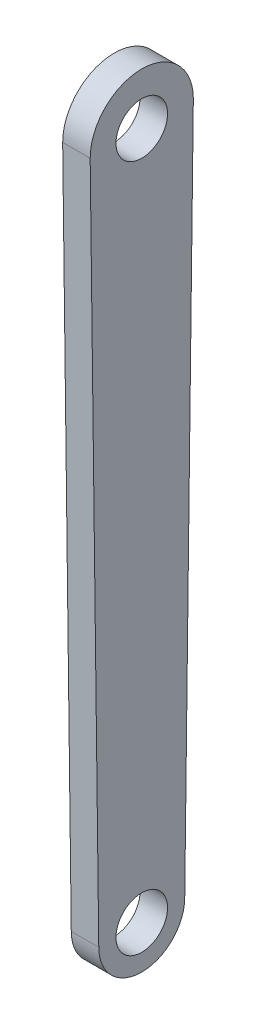
ISO-10303-21;
HEADER;
FILE_DESCRIPTION(('STEP AP214'),'2;1');
FILE_NAME('part.step','',(''),(''),'','','');
FILE_SCHEMA(('AUTOMOTIVE_DESIGN { 1 0 10303 214 1 1 1 1 }'));
ENDSEC;
DATA;
#1=APPLICATION_CONTEXT('core data for automotive mechanical design processes');
#2=APPLICATION_PROTOCOL_DEFINITION('international standard','automotive_design',2000,#1);
#3=PRODUCT_CONTEXT('',#1,'mechanical');
#4=PRODUCT('Part','Part','',(#3));
#5=PRODUCT_RELATED_PRODUCT_CATEGORY('part','',(#4));
#6=PRODUCT_DEFINITION_FORMATION('','',#4);
#7=PRODUCT_DEFINITION_CONTEXT('part definition',#1,'design');
#8=PRODUCT_DEFINITION('design','',#6,#7);
#9=PRODUCT_DEFINITION_SHAPE('','',#8);
#10=(LENGTH_UNIT() NAMED_UNIT(*) SI_UNIT(.MILLI.,.METRE.));
#11=(NAMED_UNIT(*) PLANE_ANGLE_UNIT() SI_UNIT($,.RADIAN.));
#12=(NAMED_UNIT(*) SI_UNIT($,.STERADIAN.) SOLID_ANGLE_UNIT());
#13=UNCERTAINTY_MEASURE_WITH_UNIT(LENGTH_MEASURE(1.E-05),#10,'distance_accuracy_value','');
#14=(GEOMETRIC_REPRESENTATION_CONTEXT(3) GLOBAL_UNCERTAINTY_ASSIGNED_CONTEXT((#13)) GLOBAL_UNIT_ASSIGNED_CONTEXT((#10,
#11,#12)) REPRESENTATION_CONTEXT('',''));
#15=CARTESIAN_POINT('',(0.,0.,0.));
#16=DIRECTION('',(0.,0.,1.));
#17=DIRECTION('',(1.,0.,0.));
#18=AXIS2_PLACEMENT_3D('',#15,#16,#17);
#19=CARTESIAN_POINT('',(8.,-200.,0.));
#20=DIRECTION('',(-1.,0.,0.));
#21=DIRECTION('',(0.,0.,1.));
#22=AXIS2_PLACEMENT_3D('',#19,#20,#21);
#23=CYLINDRICAL_SURFACE('',#22,12.5);
#24=CARTESIAN_POINT('',(0.,-200.,0.));
#25=DIRECTION('',(1.,0.,0.));
#26=DIRECTION('',(0.,0.,-1.));
#27=AXIS2_PLACEMENT_3D('',#24,#25,#26);
#28=CIRCLE('',#27,12.5);
#29=CARTESIAN_POINT('',(0.,-200.,12.5));
#30=VERTEX_POINT('',#29);
#31=CARTESIAN_POINT('',(0.,-200.,-12.5));
#32=VERTEX_POINT('',#31);
#33=EDGE_CURVE('E111',#30,#32,#28,.T.);
#34=ORIENTED_EDGE('',*,*,#33,.T.);
#35=DIRECTION('',(-1.,0.,0.));
#36=VECTOR('',#35,1.);
#37=CARTESIAN_POINT('',(8.,-200.,-12.5));
#38=LINE('',#37,#36);
#39=CARTESIAN_POINT('',(8.,-200.,-12.5));
#40=VERTEX_POINT('',#39);
#41=EDGE_CURVE('E11',#40,#32,#38,.T.);
#42=ORIENTED_EDGE('',*,*,#41,.F.);
#43=CARTESIAN_POINT('',(8.,-200.,0.));
#44=DIRECTION('',(1.,0.,0.));
#45=DIRECTION('',(0.,0.,-1.));
#46=AXIS2_PLACEMENT_3D('',#43,#44,#45);
#47=CIRCLE('',#46,12.5);
#48=CARTESIAN_POINT('',(8.,-200.,12.5));
#49=VERTEX_POINT('',#48);
#50=EDGE_CURVE('E86',#49,#40,#47,.T.);
#51=ORIENTED_EDGE('',*,*,#50,.F.);
#52=DIRECTION('',(-1.,0.,0.));
#53=VECTOR('',#52,1.);
#54=CARTESIAN_POINT('',(8.,-200.,12.5));
#55=LINE('',#54,#53);
#56=EDGE_CURVE('E61',#49,#30,#55,.T.);
#57=ORIENTED_EDGE('',*,*,#56,.T.);
#58=EDGE_LOOP('',(#34,#42,#51,#57));
#59=FACE_BOUND('',#58,.T.);
#60=ADVANCED_FACE('F43',(#59),#23,.T.);
#61=CARTESIAN_POINT('',(8.,-0.187470707701922,-14.9976566161537));
#62=DIRECTION('',(0.,-0.0124990235519261,-0.999921884154082));
#63=DIRECTION('',(0.,0.999921884154082,-0.0124990235519261));
#64=AXIS2_PLACEMENT_3D('',#61,#62,#63);
#65=PLANE('',#64);
#66=DIRECTION('',(0.,-0.999921884154082,0.0124990235519261));
#67=VECTOR('',#66,1.);
#68=CARTESIAN_POINT('',(0.,-0.187470707701922,-14.9976566161537));
#69=LINE('',#68,#67);
#70=CARTESIAN_POINT('',(0.,0.,-15.));
#71=VERTEX_POINT('',#70);
#72=EDGE_CURVE('E96',#71,#32,#69,.T.);
#73=ORIENTED_EDGE('',*,*,#72,.F.);
#74=DIRECTION('',(-1.,0.,0.));
#75=VECTOR('',#74,1.);
#76=CARTESIAN_POINT('',(8.,0.,-15.));
#77=LINE('',#76,#75);
#78=CARTESIAN_POINT('',(8.,0.,-15.));
#79=VERTEX_POINT('',#78);
#80=EDGE_CURVE('E52',#79,#71,#77,.T.);
#81=ORIENTED_EDGE('',*,*,#80,.F.);
#82=DIRECTION('',(0.,-0.999921884154082,0.0124990235519261));
#83=VECTOR('',#82,1.);
#84=CARTESIAN_POINT('',(8.,-0.187470707701922,-14.9976566161537));
#85=LINE('',#84,#83);
#86=EDGE_CURVE('E94',#79,#40,#85,.T.);
#87=ORIENTED_EDGE('',*,*,#86,.T.);
#88=ORIENTED_EDGE('',*,*,#41,.T.);
#89=EDGE_LOOP('',(#73,#81,#87,#88));
#90=FACE_BOUND('',#89,.T.);
#91=ADVANCED_FACE('F93',(#90),#65,.T.);
#92=CARTESIAN_POINT('',(8.,0.,0.));
#93=DIRECTION('',(-1.,0.,0.));
#94=DIRECTION('',(0.,0.,1.));
#95=AXIS2_PLACEMENT_3D('',#92,#93,#94);
#96=CYLINDRICAL_SURFACE('',#95,15.);
#97=CARTESIAN_POINT('',(0.,0.,0.));
#98=DIRECTION('',(1.,0.,0.));
#99=DIRECTION('',(0.,0.,-1.));
#100=AXIS2_PLACEMENT_3D('',#97,#98,#99);
#101=CIRCLE('',#100,15.);
#102=CARTESIAN_POINT('',(0.,0.,15.));
#103=VERTEX_POINT('',#102);
#104=EDGE_CURVE('E114',#71,#103,#101,.T.);
#105=ORIENTED_EDGE('',*,*,#104,.T.);
#106=DIRECTION('',(-1.,0.,0.));
#107=VECTOR('',#106,1.);
#108=CARTESIAN_POINT('',(8.,0.,15.));
#109=LINE('',#108,#107);
#110=CARTESIAN_POINT('',(8.,0.,15.));
#111=VERTEX_POINT('',#110);
#112=EDGE_CURVE('E75',#111,#103,#109,.T.);
#113=ORIENTED_EDGE('',*,*,#112,.F.);
#114=CARTESIAN_POINT('',(8.,0.,0.));
#115=DIRECTION('',(1.,0.,0.));
#116=DIRECTION('',(0.,0.,-1.));
#117=AXIS2_PLACEMENT_3D('',#114,#115,#116);
#118=CIRCLE('',#117,15.);
#119=EDGE_CURVE('E100',#79,#111,#118,.T.);
#120=ORIENTED_EDGE('',*,*,#119,.F.);
#121=ORIENTED_EDGE('',*,*,#80,.T.);
#122=EDGE_LOOP('',(#105,#113,#120,#121));
#123=FACE_BOUND('',#122,.T.);
#124=ADVANCED_FACE('F101',(#123),#96,.T.);
#125=CARTESIAN_POINT('',(8.,-0.187470707701922,14.9976566161537));
#126=DIRECTION('',(0.,-0.0124990235519261,0.999921884154082));
#127=DIRECTION('',(0.,-0.999921884154082,-0.0124990235519261));
#128=AXIS2_PLACEMENT_3D('',#125,#126,#127);
#129=PLANE('',#128);
#130=DIRECTION('',(0.,0.999921884154082,0.0124990235519261));
#131=VECTOR('',#130,1.);
#132=CARTESIAN_POINT('',(0.,-0.187470707701922,14.9976566161537));
#133=LINE('',#132,#131);
#134=EDGE_CURVE('E106',#30,#103,#133,.T.);
#135=ORIENTED_EDGE('',*,*,#134,.F.);
#136=ORIENTED_EDGE('',*,*,#56,.F.);
#137=DIRECTION('',(0.,0.999921884154082,0.0124990235519261));
#138=VECTOR('',#137,1.);
#139=CARTESIAN_POINT('',(8.,-0.187470707701922,14.9976566161537));
#140=LINE('',#139,#138);
#141=EDGE_CURVE('E102',#49,#111,#140,.T.);
#142=ORIENTED_EDGE('',*,*,#141,.T.);
#143=ORIENTED_EDGE('',*,*,#112,.T.);
#144=EDGE_LOOP('',(#135,#136,#142,#143));
#145=FACE_BOUND('',#144,.T.);
#146=ADVANCED_FACE('F138',(#145),#129,.T.);
#147=CARTESIAN_POINT('',(8.,0.,0.));
#148=DIRECTION('',(1.,0.,0.));
#149=DIRECTION('',(0.,0.,-1.));
#150=AXIS2_PLACEMENT_3D('',#147,#148,#149);
#151=PLANE('',#150);
#152=CARTESIAN_POINT('',(8.,0.,0.));
#153=DIRECTION('',(1.,0.,0.));
#154=DIRECTION('',(0.,0.,-1.));
#155=AXIS2_PLACEMENT_3D('',#152,#153,#154);
#156=CIRCLE('',#155,7.5);
#157=CARTESIAN_POINT('',(8.,0.,-7.5));
#158=VERTEX_POINT('',#157);
#159=EDGE_CURVE('E121',#158,#158,#156,.T.);
#160=ORIENTED_EDGE('',*,*,#159,.F.);
#161=EDGE_LOOP('',(#160));
#162=FACE_BOUND('',#161,.T.);
#163=CARTESIAN_POINT('',(8.,-200.,0.));
#164=DIRECTION('',(1.,0.,0.));
#165=DIRECTION('',(0.,0.,-1.));
#166=AXIS2_PLACEMENT_3D('',#163,#164,#165);
#167=CIRCLE('',#166,7.49999999999999);
#168=CARTESIAN_POINT('',(8.,-200.,-7.49999999999999));
#169=VERTEX_POINT('',#168);
#170=EDGE_CURVE('E126',#169,#169,#167,.T.);
#171=ORIENTED_EDGE('',*,*,#170,.F.);
#172=EDGE_LOOP('',(#171));
#173=FACE_BOUND('',#172,.T.);
#174=ORIENTED_EDGE('',*,*,#50,.T.);
#175=ORIENTED_EDGE('',*,*,#86,.F.);
#176=ORIENTED_EDGE('',*,*,#119,.T.);
#177=ORIENTED_EDGE('',*,*,#141,.F.);
#178=EDGE_LOOP('',(#174,#175,#176,#177));
#179=FACE_BOUND('',#178,.T.);
#180=ADVANCED_FACE('F104',(#162,#173,#179),#151,.T.);
#181=CARTESIAN_POINT('',(0.,0.,0.));
#182=DIRECTION('',(1.,0.,0.));
#183=DIRECTION('',(0.,0.,-1.));
#184=AXIS2_PLACEMENT_3D('',#181,#182,#183);
#185=PLANE('',#184);
#186=CARTESIAN_POINT('',(0.,0.,0.));
#187=DIRECTION('',(1.,0.,0.));
#188=DIRECTION('',(0.,0.,-1.));
#189=AXIS2_PLACEMENT_3D('',#186,#187,#188);
#190=CIRCLE('',#189,7.5);
#191=CARTESIAN_POINT('',(0.,0.,-7.5));
#192=VERTEX_POINT('',#191);
#193=EDGE_CURVE('E46',#192,#192,#190,.T.);
#194=ORIENTED_EDGE('',*,*,#193,.T.);
#195=EDGE_LOOP('',(#194));
#196=FACE_BOUND('',#195,.T.);
#197=CARTESIAN_POINT('',(0.,-200.,0.));
#198=DIRECTION('',(1.,0.,0.));
#199=DIRECTION('',(0.,0.,-1.));
#200=AXIS2_PLACEMENT_3D('',#197,#198,#199);
#201=CIRCLE('',#200,7.49999999999999);
#202=CARTESIAN_POINT('',(0.,-200.,-7.49999999999999));
#203=VERTEX_POINT('',#202);
#204=EDGE_CURVE('E119',#203,#203,#201,.T.);
#205=ORIENTED_EDGE('',*,*,#204,.T.);
#206=EDGE_LOOP('',(#205));
#207=FACE_BOUND('',#206,.T.);
#208=ORIENTED_EDGE('',*,*,#33,.F.);
#209=ORIENTED_EDGE('',*,*,#134,.T.);
#210=ORIENTED_EDGE('',*,*,#104,.F.);
#211=ORIENTED_EDGE('',*,*,#72,.T.);
#212=EDGE_LOOP('',(#208,#209,#210,#211));
#213=FACE_BOUND('',#212,.T.);
#214=ADVANCED_FACE('F137',(#196,#207,#213),#185,.F.);
#215=CARTESIAN_POINT('',(-2.,-200.,0.));
#216=DIRECTION('',(1.,0.,0.));
#217=DIRECTION('',(0.,0.,-1.));
#218=AXIS2_PLACEMENT_3D('',#215,#216,#217);
#219=CYLINDRICAL_SURFACE('',#218,7.49999999999999);
#220=ORIENTED_EDGE('',*,*,#170,.T.);
#221=EDGE_LOOP('',(#220));
#222=FACE_BOUND('',#221,.T.);
#223=ORIENTED_EDGE('',*,*,#204,.F.);
#224=EDGE_LOOP('',(#223));
#225=FACE_BOUND('',#224,.T.);
#226=ADVANCED_FACE('F133',(#222,#225),#219,.F.);
#227=CARTESIAN_POINT('',(-2.,0.,0.));
#228=DIRECTION('',(1.,0.,0.));
#229=DIRECTION('',(0.,0.,-1.));
#230=AXIS2_PLACEMENT_3D('',#227,#228,#229);
#231=CYLINDRICAL_SURFACE('',#230,7.5);
#232=ORIENTED_EDGE('',*,*,#159,.T.);
#233=EDGE_LOOP('',(#232));
#234=FACE_BOUND('',#233,.T.);
#235=ORIENTED_EDGE('',*,*,#193,.F.);
#236=EDGE_LOOP('',(#235));
#237=FACE_BOUND('',#236,.T.);
#238=ADVANCED_FACE('F187',(#234,#237),#231,.F.);
#239=CLOSED_SHELL('',(#60,#91,#124,#146,#180,#214,#226,#238));
#240=MANIFOLD_SOLID_BREP('B2',#239);
#241=ADVANCED_BREP_SHAPE_REPRESENTATION('',(#18,#240),#14);
#242=SHAPE_DEFINITION_REPRESENTATION(#9,#241);
ENDSEC;
END-ISO-10303-21;
